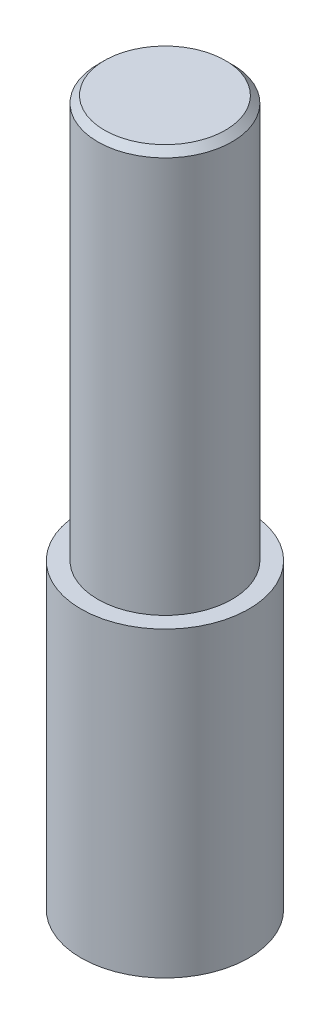
ISO-10303-21;
HEADER;
FILE_DESCRIPTION(('STEP AP214'),'2;1');
FILE_NAME('part.step','',(''),(''),'','','');
FILE_SCHEMA(('AUTOMOTIVE_DESIGN { 1 0 10303 214 1 1 1 1 }'));
ENDSEC;
DATA;
#1=APPLICATION_CONTEXT('core data for automotive mechanical design processes');
#2=APPLICATION_PROTOCOL_DEFINITION('international standard','automotive_design',2000,#1);
#3=PRODUCT_CONTEXT('',#1,'mechanical');
#4=PRODUCT('Part','Part','',(#3));
#5=PRODUCT_RELATED_PRODUCT_CATEGORY('part','',(#4));
#6=PRODUCT_DEFINITION_FORMATION('','',#4);
#7=PRODUCT_DEFINITION_CONTEXT('part definition',#1,'design');
#8=PRODUCT_DEFINITION('design','',#6,#7);
#9=PRODUCT_DEFINITION_SHAPE('','',#8);
#10=(LENGTH_UNIT() NAMED_UNIT(*) SI_UNIT(.MILLI.,.METRE.));
#11=(NAMED_UNIT(*) PLANE_ANGLE_UNIT() SI_UNIT($,.RADIAN.));
#12=(NAMED_UNIT(*) SI_UNIT($,.STERADIAN.) SOLID_ANGLE_UNIT());
#13=UNCERTAINTY_MEASURE_WITH_UNIT(LENGTH_MEASURE(1.E-05),#10,'distance_accuracy_value','');
#14=(GEOMETRIC_REPRESENTATION_CONTEXT(3) GLOBAL_UNCERTAINTY_ASSIGNED_CONTEXT((#13)) GLOBAL_UNIT_ASSIGNED_CONTEXT((#10,
#11,#12)) REPRESENTATION_CONTEXT('',''));
#15=CARTESIAN_POINT('',(0.,0.,0.));
#16=DIRECTION('',(0.,0.,1.));
#17=DIRECTION('',(1.,0.,0.));
#18=AXIS2_PLACEMENT_3D('',#15,#16,#17);
#19=CARTESIAN_POINT('',(0.,45.,0.));
#20=DIRECTION('',(0.,-1.,0.));
#21=DIRECTION('',(0.,0.,-1.));
#22=AXIS2_PLACEMENT_3D('',#19,#20,#21);
#23=CYLINDRICAL_SURFACE('',#22,12.5);
#24=CARTESIAN_POINT('',(0.,45.,0.));
#25=DIRECTION('',(0.,1.,0.));
#26=DIRECTION('',(0.,0.,1.));
#27=AXIS2_PLACEMENT_3D('',#24,#25,#26);
#28=CIRCLE('',#27,12.5);
#29=CARTESIAN_POINT('',(0.,45.,12.5));
#30=VERTEX_POINT('',#29);
#31=EDGE_CURVE('E50',#30,#30,#28,.T.);
#32=ORIENTED_EDGE('',*,*,#31,.F.);
#33=EDGE_LOOP('',(#32));
#34=FACE_BOUND('',#33,.T.);
#35=CARTESIAN_POINT('',(0.,0.,0.));
#36=DIRECTION('',(0.,1.,0.));
#37=DIRECTION('',(0.,0.,1.));
#38=AXIS2_PLACEMENT_3D('',#35,#36,#37);
#39=CIRCLE('',#38,12.5);
#40=CARTESIAN_POINT('',(0.,0.,12.5));
#41=VERTEX_POINT('',#40);
#42=EDGE_CURVE('E53',#41,#41,#39,.T.);
#43=ORIENTED_EDGE('',*,*,#42,.T.);
#44=EDGE_LOOP('',(#43));
#45=FACE_BOUND('',#44,.T.);
#46=ADVANCED_FACE('F34',(#34,#45),#23,.T.);
#47=CARTESIAN_POINT('',(0.,45.,0.));
#48=DIRECTION('',(0.,1.,0.));
#49=DIRECTION('',(0.,0.,1.));
#50=AXIS2_PLACEMENT_3D('',#47,#48,#49);
#51=PLANE('',#50);
#52=CARTESIAN_POINT('',(0.,45.,0.));
#53=DIRECTION('',(0.,1.,0.));
#54=DIRECTION('',(0.,0.,1.));
#55=AXIS2_PLACEMENT_3D('',#52,#53,#54);
#56=CIRCLE('',#55,10.);
#57=CARTESIAN_POINT('',(0.,45.,10.));
#58=VERTEX_POINT('',#57);
#59=EDGE_CURVE('E46',#58,#58,#56,.T.);
#60=ORIENTED_EDGE('',*,*,#59,.F.);
#61=EDGE_LOOP('',(#60));
#62=FACE_BOUND('',#61,.T.);
#63=ORIENTED_EDGE('',*,*,#31,.T.);
#64=EDGE_LOOP('',(#63));
#65=FACE_BOUND('',#64,.T.);
#66=ADVANCED_FACE('F59',(#62,#65),#51,.T.);
#67=CARTESIAN_POINT('',(0.,0.,0.));
#68=DIRECTION('',(0.,1.,0.));
#69=DIRECTION('',(0.,0.,1.));
#70=AXIS2_PLACEMENT_3D('',#67,#68,#69);
#71=PLANE('',#70);
#72=ORIENTED_EDGE('',*,*,#42,.F.);
#73=EDGE_LOOP('',(#72));
#74=FACE_BOUND('',#73,.T.);
#75=ADVANCED_FACE('F65',(#74),#71,.F.);
#76=CARTESIAN_POINT('',(0.,105.,0.));
#77=DIRECTION('',(0.,-1.,0.));
#78=DIRECTION('',(0.,0.,-1.));
#79=AXIS2_PLACEMENT_3D('',#76,#77,#78);
#80=CYLINDRICAL_SURFACE('',#79,10.);
#81=CARTESIAN_POINT('',(0.,104.,0.));
#82=DIRECTION('',(0.,1.,0.));
#83=DIRECTION('',(0.,0.,1.));
#84=AXIS2_PLACEMENT_3D('',#81,#82,#83);
#85=CIRCLE('',#84,10.);
#86=CARTESIAN_POINT('',(0.,104.,10.));
#87=VERTEX_POINT('',#86);
#88=EDGE_CURVE('E10',#87,#87,#85,.F.);
#89=ORIENTED_EDGE('',*,*,#88,.T.);
#90=EDGE_LOOP('',(#89));
#91=FACE_BOUND('',#90,.T.);
#92=ORIENTED_EDGE('',*,*,#59,.T.);
#93=EDGE_LOOP('',(#92));
#94=FACE_BOUND('',#93,.T.);
#95=ADVANCED_FACE('F67',(#91,#94),#80,.T.);
#96=CARTESIAN_POINT('',(0.,105.,0.));
#97=DIRECTION('',(0.,1.,0.));
#98=DIRECTION('',(0.,0.,1.));
#99=AXIS2_PLACEMENT_3D('',#96,#97,#98);
#100=PLANE('',#99);
#101=CARTESIAN_POINT('',(0.,105.,0.));
#102=DIRECTION('',(0.,1.,0.));
#103=DIRECTION('',(0.,0.,1.));
#104=AXIS2_PLACEMENT_3D('',#101,#102,#103);
#105=CIRCLE('',#104,9.00000000000001);
#106=CARTESIAN_POINT('',(0.,105.,9.00000000000001));
#107=VERTEX_POINT('',#106);
#108=EDGE_CURVE('E42',#107,#107,#105,.T.);
#109=ORIENTED_EDGE('',*,*,#108,.T.);
#110=EDGE_LOOP('',(#109));
#111=FACE_BOUND('',#110,.T.);
#112=ADVANCED_FACE('F73',(#111),#100,.T.);
#113=CARTESIAN_POINT('',(0.,105.,0.));
#114=DIRECTION('',(0.,-1.,0.));
#115=DIRECTION('',(0.,0.,-1.));
#116=AXIS2_PLACEMENT_3D('',#113,#114,#115);
#117=CONICAL_SURFACE('',#116,9.00000000000001,0.785398163397444);
#118=ORIENTED_EDGE('',*,*,#88,.F.);
#119=EDGE_LOOP('',(#118));
#120=FACE_BOUND('',#119,.T.);
#121=ORIENTED_EDGE('',*,*,#108,.F.);
#122=EDGE_LOOP('',(#121));
#123=FACE_BOUND('',#122,.T.);
#124=ADVANCED_FACE('F37',(#120,#123),#117,.T.);
#125=CLOSED_SHELL('',(#46,#66,#75,#95,#112,#124));
#126=MANIFOLD_SOLID_BREP('B2',#125);
#127=ADVANCED_BREP_SHAPE_REPRESENTATION('',(#18,#126),#14);
#128=SHAPE_DEFINITION_REPRESENTATION(#9,#127);
ENDSEC;
END-ISO-10303-21;
